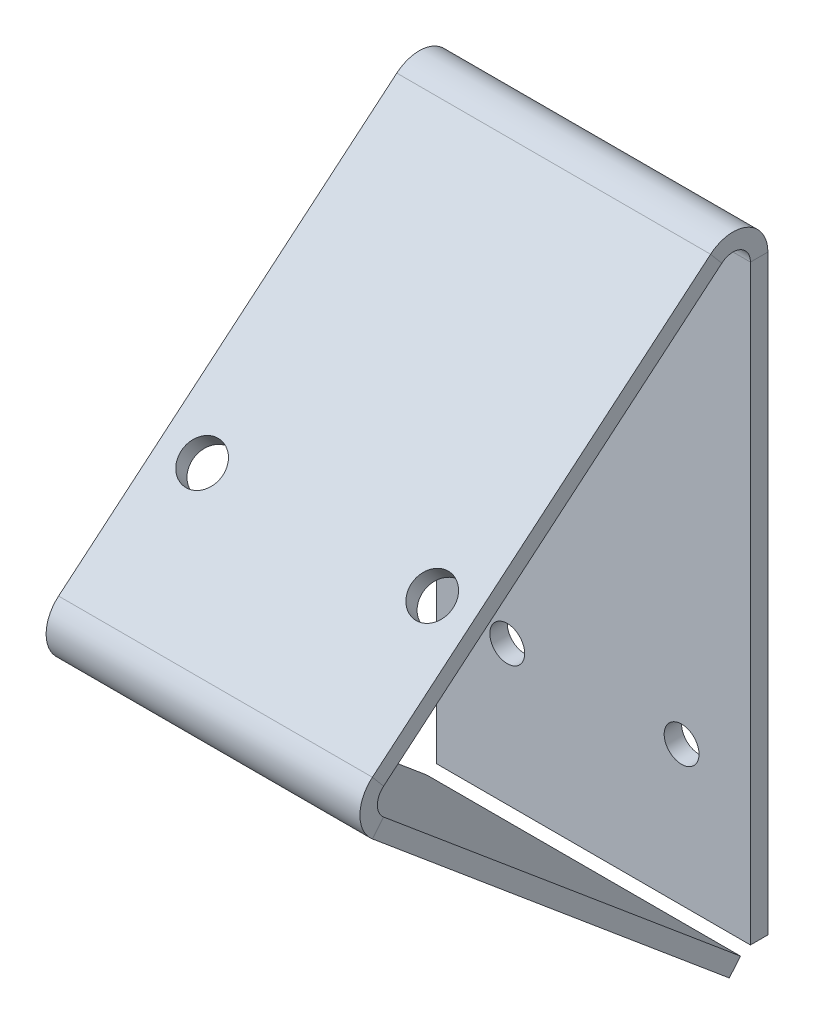
ISO-10303-21;
HEADER;
FILE_DESCRIPTION(('STEP AP214'),'2;1');
FILE_NAME('part.step','',(''),(''),'','','');
FILE_SCHEMA(('AUTOMOTIVE_DESIGN { 1 0 10303 214 1 1 1 1 }'));
ENDSEC;
DATA;
#1=APPLICATION_CONTEXT('core data for automotive mechanical design processes');
#2=APPLICATION_PROTOCOL_DEFINITION('international standard','automotive_design',2000,#1);
#3=PRODUCT_CONTEXT('',#1,'mechanical');
#4=PRODUCT('Part','Part','',(#3));
#5=PRODUCT_RELATED_PRODUCT_CATEGORY('part','',(#4));
#6=PRODUCT_DEFINITION_FORMATION('','',#4);
#7=PRODUCT_DEFINITION_CONTEXT('part definition',#1,'design');
#8=PRODUCT_DEFINITION('design','',#6,#7);
#9=PRODUCT_DEFINITION_SHAPE('','',#8);
#10=(LENGTH_UNIT() NAMED_UNIT(*) SI_UNIT(.MILLI.,.METRE.));
#11=(NAMED_UNIT(*) PLANE_ANGLE_UNIT() SI_UNIT($,.RADIAN.));
#12=(NAMED_UNIT(*) SI_UNIT($,.STERADIAN.) SOLID_ANGLE_UNIT());
#13=UNCERTAINTY_MEASURE_WITH_UNIT(LENGTH_MEASURE(1.E-05),#10,'distance_accuracy_value','');
#14=(GEOMETRIC_REPRESENTATION_CONTEXT(3) GLOBAL_UNCERTAINTY_ASSIGNED_CONTEXT((#13)) GLOBAL_UNIT_ASSIGNED_CONTEXT((#10,
#11,#12)) REPRESENTATION_CONTEXT('',''));
#15=CARTESIAN_POINT('',(0.,0.,0.));
#16=DIRECTION('',(0.,0.,1.));
#17=DIRECTION('',(1.,0.,0.));
#18=AXIS2_PLACEMENT_3D('',#15,#16,#17);
#19=CARTESIAN_POINT('',(-216.953914114597,121.828309810006,102.226089828528));
#20=DIRECTION('',(1.,0.,0.));
#21=DIRECTION('',(0.,-0.642787609686543,0.766044443118975));
#22=AXIS2_PLACEMENT_3D('',#19,#20,#21);
#23=PLANE('',#22);
#24=DIRECTION('',(0.,0.766044443118975,0.642787609686543));
#25=VECTOR('',#24,1.);
#26=CARTESIAN_POINT('',(-216.953914114597,142.748478512065,77.2944036201722));
#27=LINE('',#26,#25);
#28=CARTESIAN_POINT('',(-216.953914114597,140.316287405162,75.2535529594174));
#29=VERTEX_POINT('',#28);
#30=CARTESIAN_POINT('',(-216.953914114597,142.748478512065,77.2944036201722));
#31=VERTEX_POINT('',#30);
#32=EDGE_CURVE('E12',#29,#31,#27,.T.);
#33=ORIENTED_EDGE('',*,*,#32,.F.);
#34=DIRECTION('',(0.,0.642787609686543,-0.766044443118975));
#35=VECTOR('',#34,1.);
#36=CARTESIAN_POINT('',(-216.953914114597,119.396118703103,100.185239167773));
#37=LINE('',#36,#35);
#38=CARTESIAN_POINT('',(-216.953914114597,192.001158760502,13.657921838922));
#39=VERTEX_POINT('',#38);
#40=EDGE_CURVE('E167',#39,#29,#37,.F.);
#41=ORIENTED_EDGE('',*,*,#40,.F.);
#42=DIRECTION('',(0.,0.766044443118974,0.642787609686544));
#43=VECTOR('',#42,1.);
#44=CARTESIAN_POINT('',(-216.953914114597,194.433349867405,15.6987724996768));
#45=LINE('',#44,#43);
#46=CARTESIAN_POINT('',(-216.953914114597,194.433349867405,15.6987724996768));
#47=VERTEX_POINT('',#46);
#48=EDGE_CURVE('E57',#39,#47,#45,.T.);
#49=ORIENTED_EDGE('',*,*,#48,.T.);
#50=DIRECTION('',(0.,-0.642787609686543,0.766044443118975));
#51=VECTOR('',#50,1.);
#52=CARTESIAN_POINT('',(-216.953914114597,121.828309810006,102.226089828528));
#53=LINE('',#52,#51);
#54=EDGE_CURVE('E265',#47,#31,#53,.T.);
#55=ORIENTED_EDGE('',*,*,#54,.T.);
#56=EDGE_LOOP('',(#33,#41,#49,#55));
#57=FACE_BOUND('',#56,.T.);
#58=ADVANCED_FACE('F47',(#57),#23,.T.);
#59=CARTESIAN_POINT('',(-216.953914114597,189.5689676536,11.6170711781672));
#60=DIRECTION('',(-1.,0.,0.));
#61=DIRECTION('',(0.,0.,1.));
#62=AXIS2_PLACEMENT_3D('',#59,#60,#61);
#63=PLANE('',#62);
#64=ORIENTED_EDGE('',*,*,#48,.F.);
#65=CARTESIAN_POINT('',(-216.953914114597,189.5689676536,11.6170711781672));
#66=DIRECTION('',(-1.,0.,0.));
#67=DIRECTION('',(0.,0.,1.));
#68=AXIS2_PLACEMENT_3D('',#65,#66,#67);
#69=CIRCLE('',#68,3.175);
#70=CARTESIAN_POINT('',(-216.953914114597,189.5689676536,8.44207117816722));
#71=VERTEX_POINT('',#70);
#72=EDGE_CURVE('E171',#39,#71,#69,.T.);
#73=ORIENTED_EDGE('',*,*,#72,.T.);
#74=DIRECTION('',(0.,0.,-1.));
#75=VECTOR('',#74,1.);
#76=CARTESIAN_POINT('',(-216.953914114597,189.5689676536,5.26707117816722));
#77=LINE('',#76,#75);
#78=CARTESIAN_POINT('',(-216.953914114597,189.5689676536,5.26707117816722));
#79=VERTEX_POINT('',#78);
#80=EDGE_CURVE('E205',#71,#79,#77,.T.);
#81=ORIENTED_EDGE('',*,*,#80,.T.);
#82=CARTESIAN_POINT('',(-216.953914114597,189.5689676536,11.6170711781672));
#83=DIRECTION('',(1.,0.,0.));
#84=DIRECTION('',(0.,0.,-1.));
#85=AXIS2_PLACEMENT_3D('',#82,#83,#84);
#86=CIRCLE('',#85,6.35);
#87=EDGE_CURVE('E282',#47,#79,#86,.F.);
#88=ORIENTED_EDGE('',*,*,#87,.F.);
#89=EDGE_LOOP('',(#64,#73,#81,#88));
#90=FACE_BOUND('',#89,.T.);
#91=ADVANCED_FACE('F301',(#90),#63,.F.);
#92=CARTESIAN_POINT('',(-216.953914114597,0.,5.26707117816726));
#93=DIRECTION('',(1.,0.,0.));
#94=DIRECTION('',(0.,1.,0.));
#95=AXIS2_PLACEMENT_3D('',#92,#93,#94);
#96=PLANE('',#95);
#97=ORIENTED_EDGE('',*,*,#80,.F.);
#98=DIRECTION('',(0.,-1.,0.));
#99=VECTOR('',#98,1.);
#100=CARTESIAN_POINT('',(-216.953914114597,0.,8.44207117816726));
#101=LINE('',#100,#99);
#102=CARTESIAN_POINT('',(-216.953914114597,81.8630845770558,8.44207117816724));
#103=VERTEX_POINT('',#102);
#104=EDGE_CURVE('E157',#103,#71,#101,.F.);
#105=ORIENTED_EDGE('',*,*,#104,.F.);
#106=DIRECTION('',(0.,0.,-1.));
#107=VECTOR('',#106,1.);
#108=CARTESIAN_POINT('',(-216.953914114597,81.8630845770558,5.26707117816724));
#109=LINE('',#108,#107);
#110=CARTESIAN_POINT('',(-216.953914114597,81.8630845770558,5.26707117816724));
#111=VERTEX_POINT('',#110);
#112=EDGE_CURVE('E202',#103,#111,#109,.T.);
#113=ORIENTED_EDGE('',*,*,#112,.T.);
#114=DIRECTION('',(0.,1.,0.));
#115=VECTOR('',#114,1.);
#116=CARTESIAN_POINT('',(-216.953914114597,0.,5.26707117816726));
#117=LINE('',#116,#115);
#118=EDGE_CURVE('E249',#111,#79,#117,.T.);
#119=ORIENTED_EDGE('',*,*,#118,.T.);
#120=EDGE_LOOP('',(#97,#105,#113,#119));
#121=FACE_BOUND('',#120,.T.);
#122=ADVANCED_FACE('F247',(#121),#96,.T.);
#123=CARTESIAN_POINT('',(-216.953914114597,81.8630845770558,5.26707117816724));
#124=DIRECTION('',(0.,1.,0.));
#125=DIRECTION('',(-1.,0.,0.));
#126=AXIS2_PLACEMENT_3D('',#123,#124,#125);
#127=PLANE('',#126);
#128=ORIENTED_EDGE('',*,*,#112,.F.);
#129=DIRECTION('',(1.,0.,0.));
#130=VECTOR('',#129,1.);
#131=CARTESIAN_POINT('',(-216.953914114597,81.8630845770558,8.44207117816724));
#132=LINE('',#131,#130);
#133=CARTESIAN_POINT('',(-274.103914114597,81.8630845770558,8.44207117816724));
#134=VERTEX_POINT('',#133);
#135=EDGE_CURVE('E152',#103,#134,#132,.F.);
#136=ORIENTED_EDGE('',*,*,#135,.T.);
#137=DIRECTION('',(0.,0.,-1.));
#138=VECTOR('',#137,1.);
#139=CARTESIAN_POINT('',(-274.103914114597,81.8630845770558,5.26707117816724));
#140=LINE('',#139,#138);
#141=CARTESIAN_POINT('',(-274.103914114597,81.8630845770558,5.26707117816724));
#142=VERTEX_POINT('',#141);
#143=EDGE_CURVE('E199',#134,#142,#140,.T.);
#144=ORIENTED_EDGE('',*,*,#143,.T.);
#145=DIRECTION('',(-1.,0.,0.));
#146=VECTOR('',#145,1.);
#147=CARTESIAN_POINT('',(-216.953914114597,81.8630845770558,5.26707117816724));
#148=LINE('',#147,#146);
#149=EDGE_CURVE('E243',#111,#142,#148,.T.);
#150=ORIENTED_EDGE('',*,*,#149,.F.);
#151=EDGE_LOOP('',(#128,#136,#144,#150));
#152=FACE_BOUND('',#151,.T.);
#153=ADVANCED_FACE('F239',(#152),#127,.F.);
#154=CARTESIAN_POINT('',(-274.103914114597,0.,5.26707117816726));
#155=DIRECTION('',(1.,0.,0.));
#156=DIRECTION('',(0.,1.,0.));
#157=AXIS2_PLACEMENT_3D('',#154,#155,#156);
#158=PLANE('',#157);
#159=ORIENTED_EDGE('',*,*,#143,.F.);
#160=DIRECTION('',(0.,-1.,0.));
#161=VECTOR('',#160,1.);
#162=CARTESIAN_POINT('',(-274.103914114597,0.,8.44207117816726));
#163=LINE('',#162,#161);
#164=CARTESIAN_POINT('',(-274.103914114597,189.5689676536,8.44207117816721));
#165=VERTEX_POINT('',#164);
#166=EDGE_CURVE('E172',#134,#165,#163,.F.);
#167=ORIENTED_EDGE('',*,*,#166,.T.);
#168=DIRECTION('',(0.,0.,-1.));
#169=VECTOR('',#168,1.);
#170=CARTESIAN_POINT('',(-274.103914114597,189.5689676536,5.26707117816722));
#171=LINE('',#170,#169);
#172=CARTESIAN_POINT('',(-274.103914114597,189.5689676536,5.26707117816722));
#173=VERTEX_POINT('',#172);
#174=EDGE_CURVE('E196',#165,#173,#171,.T.);
#175=ORIENTED_EDGE('',*,*,#174,.T.);
#176=DIRECTION('',(0.,1.,0.));
#177=VECTOR('',#176,1.);
#178=CARTESIAN_POINT('',(-274.103914114597,0.,5.26707117816726));
#179=LINE('',#178,#177);
#180=EDGE_CURVE('E260',#142,#173,#179,.T.);
#181=ORIENTED_EDGE('',*,*,#180,.F.);
#182=EDGE_LOOP('',(#159,#167,#175,#181));
#183=FACE_BOUND('',#182,.T.);
#184=ADVANCED_FACE('F312',(#183),#158,.F.);
#185=CARTESIAN_POINT('',(-274.103914114597,189.5689676536,11.6170711781672));
#186=DIRECTION('',(1.,0.,0.));
#187=DIRECTION('',(0.,0.,-1.));
#188=AXIS2_PLACEMENT_3D('',#185,#186,#187);
#189=PLANE('',#188);
#190=ORIENTED_EDGE('',*,*,#174,.F.);
#191=CARTESIAN_POINT('',(-274.103914114597,189.5689676536,11.6170711781672));
#192=DIRECTION('',(-1.,0.,0.));
#193=DIRECTION('',(0.,0.,1.));
#194=AXIS2_PLACEMENT_3D('',#191,#192,#193);
#195=CIRCLE('',#194,3.175);
#196=CARTESIAN_POINT('',(-274.103914114597,192.001158760502,13.657921838922));
#197=VERTEX_POINT('',#196);
#198=EDGE_CURVE('E147',#165,#197,#195,.F.);
#199=ORIENTED_EDGE('',*,*,#198,.T.);
#200=DIRECTION('',(0.,0.766044443118975,0.642787609686543));
#201=VECTOR('',#200,1.);
#202=CARTESIAN_POINT('',(-274.103914114597,194.433349867405,15.6987724996768));
#203=LINE('',#202,#201);
#204=CARTESIAN_POINT('',(-274.103914114597,194.433349867405,15.6987724996768));
#205=VERTEX_POINT('',#204);
#206=EDGE_CURVE('E193',#197,#205,#203,.T.);
#207=ORIENTED_EDGE('',*,*,#206,.T.);
#208=CARTESIAN_POINT('',(-274.103914114597,189.5689676536,11.6170711781672));
#209=DIRECTION('',(-1.,0.,0.));
#210=DIRECTION('',(0.,0.,1.));
#211=AXIS2_PLACEMENT_3D('',#208,#209,#210);
#212=CIRCLE('',#211,6.35);
#213=EDGE_CURVE('E279',#173,#205,#212,.F.);
#214=ORIENTED_EDGE('',*,*,#213,.F.);
#215=EDGE_LOOP('',(#190,#199,#207,#214));
#216=FACE_BOUND('',#215,.T.);
#217=ADVANCED_FACE('F308',(#216),#189,.F.);
#218=CARTESIAN_POINT('',(-274.103914114597,121.828309810006,102.226089828528));
#219=DIRECTION('',(1.,0.,0.));
#220=DIRECTION('',(0.,-0.642787609686543,0.766044443118975));
#221=AXIS2_PLACEMENT_3D('',#218,#219,#220);
#222=PLANE('',#221);
#223=ORIENTED_EDGE('',*,*,#206,.F.);
#224=DIRECTION('',(0.,0.642787609686543,-0.766044443118975));
#225=VECTOR('',#224,1.);
#226=CARTESIAN_POINT('',(-274.103914114597,119.396118703103,100.185239167773));
#227=LINE('',#226,#225);
#228=CARTESIAN_POINT('',(-274.103914114597,140.316287405162,75.2535529594174));
#229=VERTEX_POINT('',#228);
#230=EDGE_CURVE('E165',#197,#229,#227,.F.);
#231=ORIENTED_EDGE('',*,*,#230,.T.);
#232=DIRECTION('',(0.,0.766044443118975,0.642787609686543));
#233=VECTOR('',#232,1.);
#234=CARTESIAN_POINT('',(-274.103914114597,142.748478512065,77.2944036201722));
#235=LINE('',#234,#233);
#236=CARTESIAN_POINT('',(-274.103914114597,142.748478512065,77.2944036201722));
#237=VERTEX_POINT('',#236);
#238=EDGE_CURVE('E66',#229,#237,#235,.T.);
#239=ORIENTED_EDGE('',*,*,#238,.T.);
#240=DIRECTION('',(0.,-0.642787609686543,0.766044443118975));
#241=VECTOR('',#240,1.);
#242=CARTESIAN_POINT('',(-274.103914114597,121.828309810006,102.226089828528));
#243=LINE('',#242,#241);
#244=EDGE_CURVE('E649',#205,#237,#243,.T.);
#245=ORIENTED_EDGE('',*,*,#244,.F.);
#246=EDGE_LOOP('',(#223,#231,#239,#245));
#247=FACE_BOUND('',#246,.T.);
#248=ADVANCED_FACE('F529',(#247),#222,.F.);
#249=CARTESIAN_POINT('',(-274.103914114597,137.88409629826,73.2127022986627));
#250=DIRECTION('',(1.,0.,0.));
#251=DIRECTION('',(0.,0.,-1.));
#252=AXIS2_PLACEMENT_3D('',#249,#250,#251);
#253=PLANE('',#252);
#254=ORIENTED_EDGE('',*,*,#238,.F.);
#255=CARTESIAN_POINT('',(-274.103914114597,137.88409629826,73.2127022986627));
#256=DIRECTION('',(-1.,0.,0.));
#257=DIRECTION('',(0.,0.,1.));
#258=AXIS2_PLACEMENT_3D('',#255,#256,#257);
#259=CIRCLE('',#258,3.175);
#260=CARTESIAN_POINT('',(-274.103914114597,135.449952750407,75.2512238679499));
#261=VERTEX_POINT('',#260);
#262=EDGE_CURVE('E148',#229,#261,#259,.F.);
#263=ORIENTED_EDGE('',*,*,#262,.T.);
#264=DIRECTION('',(0.,-0.766659385150302,0.642054037570795));
#265=VECTOR('',#264,1.);
#266=CARTESIAN_POINT('',(-274.103914114597,133.015809202555,77.2897454372372));
#267=LINE('',#266,#265);
#268=CARTESIAN_POINT('',(-274.103914114597,133.015809202555,77.2897454372372));
#269=VERTEX_POINT('',#268);
#270=EDGE_CURVE('E189',#261,#269,#267,.T.);
#271=ORIENTED_EDGE('',*,*,#270,.T.);
#272=CARTESIAN_POINT('',(-274.103914114597,137.88409629826,73.2127022986627));
#273=DIRECTION('',(-1.,0.,0.));
#274=DIRECTION('',(0.,0.,1.));
#275=AXIS2_PLACEMENT_3D('',#272,#273,#274);
#276=CIRCLE('',#275,6.35);
#277=EDGE_CURVE('E290',#237,#269,#276,.F.);
#278=ORIENTED_EDGE('',*,*,#277,.F.);
#279=EDGE_LOOP('',(#254,#263,#271,#278));
#280=FACE_BOUND('',#279,.T.);
#281=ADVANCED_FACE('F339',(#280),#253,.F.);
#282=CARTESIAN_POINT('',(-274.103914114597,40.1373982424596,-33.6138565552235));
#283=DIRECTION('',(1.,0.,0.));
#284=DIRECTION('',(0.,-0.642054037570795,-0.766659385150302));
#285=AXIS2_PLACEMENT_3D('',#282,#283,#284);
#286=PLANE('',#285);
#287=ORIENTED_EDGE('',*,*,#270,.F.);
#288=DIRECTION('',(0.,0.642054037570795,0.766659385150303));
#289=VECTOR('',#288,1.);
#290=CARTESIAN_POINT('',(-274.103914114597,42.5715417903118,-35.6523781245108));
#291=LINE('',#290,#289);
#292=CARTESIAN_POINT('',(-274.103914114597,81.0169806089417,10.254282003414));
#293=VERTEX_POINT('',#292);
#294=EDGE_CURVE('E137',#261,#293,#291,.F.);
#295=ORIENTED_EDGE('',*,*,#294,.T.);
#296=DIRECTION('',(0.,-0.766659385150302,0.642054037570795));
#297=VECTOR('',#296,1.);
#298=CARTESIAN_POINT('',(-274.103914114597,78.5828370610895,12.2928035727013));
#299=LINE('',#298,#297);
#300=CARTESIAN_POINT('',(-274.103914114597,78.5828370610895,12.2928035727013));
#301=VERTEX_POINT('',#300);
#302=EDGE_CURVE('E186',#293,#301,#299,.T.);
#303=ORIENTED_EDGE('',*,*,#302,.T.);
#304=DIRECTION('',(0.,-0.642054037570795,-0.766659385150302));
#305=VECTOR('',#304,1.);
#306=CARTESIAN_POINT('',(-274.103914114597,40.1373982424596,-33.6138565552235));
#307=LINE('',#306,#305);
#308=EDGE_CURVE('E259',#269,#301,#307,.T.);
#309=ORIENTED_EDGE('',*,*,#308,.F.);
#310=EDGE_LOOP('',(#287,#295,#303,#309));
#311=FACE_BOUND('',#310,.T.);
#312=ADVANCED_FACE('F325',(#311),#286,.F.);
#313=CARTESIAN_POINT('',(-216.953914114597,78.5828370610895,12.2928035727013));
#314=DIRECTION('',(0.,0.642054037570795,0.766659385150303));
#315=DIRECTION('',(1.,0.,0.));
#316=AXIS2_PLACEMENT_3D('',#313,#314,#315);
#317=PLANE('',#316);
#318=ORIENTED_EDGE('',*,*,#302,.F.);
#319=DIRECTION('',(1.,0.,0.));
#320=VECTOR('',#319,1.);
#321=CARTESIAN_POINT('',(-216.953914114597,81.0169806089417,10.254282003414));
#322=LINE('',#321,#320);
#323=CARTESIAN_POINT('',(-216.953914114597,81.0169806089417,10.254282003414));
#324=VERTEX_POINT('',#323);
#325=EDGE_CURVE('E155',#293,#324,#322,.T.);
#326=ORIENTED_EDGE('',*,*,#325,.T.);
#327=DIRECTION('',(0.,-0.766659385150302,0.642054037570795));
#328=VECTOR('',#327,1.);
#329=CARTESIAN_POINT('',(-216.953914114597,78.5828370610895,12.2928035727013));
#330=LINE('',#329,#328);
#331=CARTESIAN_POINT('',(-216.953914114597,78.5828370610895,12.2928035727013));
#332=VERTEX_POINT('',#331);
#333=EDGE_CURVE('E124',#324,#332,#330,.T.);
#334=ORIENTED_EDGE('',*,*,#333,.T.);
#335=DIRECTION('',(1.,0.,0.));
#336=VECTOR('',#335,1.);
#337=CARTESIAN_POINT('',(-216.953914114597,78.5828370610895,12.2928035727013));
#338=LINE('',#337,#336);
#339=EDGE_CURVE('E271',#301,#332,#338,.T.);
#340=ORIENTED_EDGE('',*,*,#339,.F.);
#341=EDGE_LOOP('',(#318,#326,#334,#340));
#342=FACE_BOUND('',#341,.T.);
#343=ADVANCED_FACE('F330',(#342),#317,.F.);
#344=CARTESIAN_POINT('',(-216.953914114597,40.1373982424596,-33.6138565552235));
#345=DIRECTION('',(1.,0.,0.));
#346=DIRECTION('',(0.,-0.642054037570795,-0.766659385150302));
#347=AXIS2_PLACEMENT_3D('',#344,#345,#346);
#348=PLANE('',#347);
#349=ORIENTED_EDGE('',*,*,#333,.F.);
#350=DIRECTION('',(0.,0.642054037570795,0.766659385150303));
#351=VECTOR('',#350,1.);
#352=CARTESIAN_POINT('',(-216.953914114597,42.5715417903118,-35.6523781245108));
#353=LINE('',#352,#351);
#354=CARTESIAN_POINT('',(-216.953914114597,135.449952750407,75.25122386795));
#355=VERTEX_POINT('',#354);
#356=EDGE_CURVE('E134',#355,#324,#353,.F.);
#357=ORIENTED_EDGE('',*,*,#356,.F.);
#358=DIRECTION('',(0.,-0.766659385150302,0.642054037570796));
#359=VECTOR('',#358,1.);
#360=CARTESIAN_POINT('',(-216.953914114597,133.015809202555,77.2897454372372));
#361=LINE('',#360,#359);
#362=CARTESIAN_POINT('',(-216.953914114597,133.015809202555,77.2897454372372));
#363=VERTEX_POINT('',#362);
#364=EDGE_CURVE('E112',#355,#363,#361,.T.);
#365=ORIENTED_EDGE('',*,*,#364,.T.);
#366=DIRECTION('',(0.,-0.642054037570795,-0.766659385150302));
#367=VECTOR('',#366,1.);
#368=CARTESIAN_POINT('',(-216.953914114597,40.1373982424596,-33.6138565552235));
#369=LINE('',#368,#367);
#370=EDGE_CURVE('E263',#363,#332,#369,.T.);
#371=ORIENTED_EDGE('',*,*,#370,.T.);
#372=EDGE_LOOP('',(#349,#357,#365,#371));
#373=FACE_BOUND('',#372,.T.);
#374=ADVANCED_FACE('F150',(#373),#348,.T.);
#375=CARTESIAN_POINT('',(-266.483914114597,158.28787206223,58.7752755300277));
#376=DIRECTION('',(0.,-0.766044443118975,-0.642787609686543));
#377=DIRECTION('',(0.,0.642787609686543,-0.766044443118975));
#378=AXIS2_PLACEMENT_3D('',#375,#376,#377);
#379=CYLINDRICAL_SURFACE('',#378,3.80999999999998);
#380=CARTESIAN_POINT('',(-266.483914114597,158.28787206223,58.7752755300277));
#381=DIRECTION('',(0.,0.766044443118975,0.642787609686543));
#382=DIRECTION('',(0.,-0.642787609686543,0.766044443118975));
#383=AXIS2_PLACEMENT_3D('',#380,#381,#382);
#384=CIRCLE('',#383,3.80999999999998);
#385=CARTESIAN_POINT('',(-266.483914114597,155.838851269325,61.6939048583109));
#386=VERTEX_POINT('',#385);
#387=EDGE_CURVE('E285',#386,#386,#384,.T.);
#388=ORIENTED_EDGE('',*,*,#387,.T.);
#389=EDGE_LOOP('',(#388));
#390=FACE_BOUND('',#389,.T.);
#391=CARTESIAN_POINT('',(-266.483914114597,155.855680955328,56.7344248692729));
#392=DIRECTION('',(0.,0.766044443118975,0.642787609686543));
#393=DIRECTION('',(0.,-0.642787609686543,0.766044443118975));
#394=AXIS2_PLACEMENT_3D('',#391,#392,#393);
#395=CIRCLE('',#394,3.80999999999998);
#396=CARTESIAN_POINT('',(-266.483914114597,153.406660162422,59.6530541975562));
#397=VERTEX_POINT('',#396);
#398=EDGE_CURVE('E179',#397,#397,#395,.T.);
#399=ORIENTED_EDGE('',*,*,#398,.F.);
#400=EDGE_LOOP('',(#399));
#401=FACE_BOUND('',#400,.T.);
#402=ADVANCED_FACE('F337',(#390,#401),#379,.F.);
#403=CARTESIAN_POINT('',(-224.573914114597,158.28787206223,58.7752755300276));
#404=DIRECTION('',(0.,-0.766044443118975,-0.642787609686543));
#405=DIRECTION('',(0.,0.642787609686543,-0.766044443118975));
#406=AXIS2_PLACEMENT_3D('',#403,#404,#405);
#407=CYLINDRICAL_SURFACE('',#406,3.81000000000002);
#408=CARTESIAN_POINT('',(-224.573914114597,158.28787206223,58.7752755300276));
#409=DIRECTION('',(0.,0.766044443118975,0.642787609686543));
#410=DIRECTION('',(0.,-0.642787609686543,0.766044443118975));
#411=AXIS2_PLACEMENT_3D('',#408,#409,#410);
#412=CIRCLE('',#411,3.81000000000002);
#413=CARTESIAN_POINT('',(-224.573914114597,155.838851269325,61.693904858311));
#414=VERTEX_POINT('',#413);
#415=EDGE_CURVE('E650',#414,#414,#412,.T.);
#416=ORIENTED_EDGE('',*,*,#415,.T.);
#417=EDGE_LOOP('',(#416));
#418=FACE_BOUND('',#417,.T.);
#419=CARTESIAN_POINT('',(-224.573914114597,155.855680955328,56.7344248692729));
#420=DIRECTION('',(0.,0.766044443118975,0.642787609686543));
#421=DIRECTION('',(0.,-0.642787609686543,0.766044443118975));
#422=AXIS2_PLACEMENT_3D('',#419,#420,#421);
#423=CIRCLE('',#422,3.81000000000002);
#424=CARTESIAN_POINT('',(-224.573914114597,153.406660162422,59.6530541975562));
#425=VERTEX_POINT('',#424);
#426=EDGE_CURVE('E168',#425,#425,#423,.T.);
#427=ORIENTED_EDGE('',*,*,#426,.F.);
#428=EDGE_LOOP('',(#427));
#429=FACE_BOUND('',#428,.T.);
#430=ADVANCED_FACE('F49',(#418,#429),#407,.F.);
#431=CARTESIAN_POINT('',(-216.953914114597,137.88409629826,73.2127022986627));
#432=DIRECTION('',(-1.,0.,0.));
#433=DIRECTION('',(0.,0.,1.));
#434=AXIS2_PLACEMENT_3D('',#431,#432,#433);
#435=PLANE('',#434);
#436=CARTESIAN_POINT('',(-216.953914114597,137.88409629826,73.2127022986627));
#437=DIRECTION('',(-1.,0.,0.));
#438=DIRECTION('',(0.,0.,1.));
#439=AXIS2_PLACEMENT_3D('',#436,#437,#438);
#440=CIRCLE('',#439,3.175);
#441=EDGE_CURVE('E116',#355,#29,#440,.T.);
#442=ORIENTED_EDGE('',*,*,#441,.T.);
#443=ORIENTED_EDGE('',*,*,#32,.T.);
#444=CARTESIAN_POINT('',(-216.953914114597,137.88409629826,73.2127022986627));
#445=DIRECTION('',(1.,0.,0.));
#446=DIRECTION('',(0.,0.,-1.));
#447=AXIS2_PLACEMENT_3D('',#444,#445,#446);
#448=CIRCLE('',#447,6.35);
#449=EDGE_CURVE('E118',#363,#31,#448,.F.);
#450=ORIENTED_EDGE('',*,*,#449,.F.);
#451=ORIENTED_EDGE('',*,*,#364,.F.);
#452=EDGE_LOOP('',(#442,#443,#450,#451));
#453=FACE_BOUND('',#452,.T.);
#454=ADVANCED_FACE('F114',(#453),#435,.F.);
#455=CARTESIAN_POINT('',(-216.953914114597,40.1373982424596,-33.6138565552235));
#456=DIRECTION('',(0.,0.766659385150302,-0.642054037570795));
#457=DIRECTION('',(0.,0.642054037570795,0.766659385150303));
#458=AXIS2_PLACEMENT_3D('',#455,#456,#457);
#459=PLANE('',#458);
#460=ORIENTED_EDGE('',*,*,#370,.F.);
#461=DIRECTION('',(-1.,0.,0.));
#462=VECTOR('',#461,1.);
#463=CARTESIAN_POINT('',(-216.953914114597,133.015809202555,77.2897454372372));
#464=LINE('',#463,#462);
#465=EDGE_CURVE('E278',#363,#269,#464,.T.);
#466=ORIENTED_EDGE('',*,*,#465,.T.);
#467=ORIENTED_EDGE('',*,*,#308,.T.);
#468=ORIENTED_EDGE('',*,*,#339,.T.);
#469=EDGE_LOOP('',(#460,#466,#467,#468));
#470=FACE_BOUND('',#469,.T.);
#471=ADVANCED_FACE('F329',(#470),#459,.F.);
#472=CARTESIAN_POINT('',(-216.953914114597,0.,5.26707117816726));
#473=DIRECTION('',(0.,0.,1.));
#474=DIRECTION('',(0.,-1.,0.));
#475=AXIS2_PLACEMENT_3D('',#472,#473,#474);
#476=PLANE('',#475);
#477=CARTESIAN_POINT('',(-229.494923600473,107.263084577056,5.26707117816726));
#478=DIRECTION('',(0.,0.,-1.));
#479=DIRECTION('',(-1.,0.,0.));
#480=AXIS2_PLACEMENT_3D('',#477,#478,#479);
#481=CIRCLE('',#480,3.175);
#482=CARTESIAN_POINT('',(-232.669923600473,107.263084577056,5.26707117816726));
#483=VERTEX_POINT('',#482);
#484=EDGE_CURVE('E213',#483,#483,#481,.T.);
#485=ORIENTED_EDGE('',*,*,#484,.F.);
#486=EDGE_LOOP('',(#485));
#487=FACE_BOUND('',#486,.T.);
#488=CARTESIAN_POINT('',(-261.244923600473,107.263084577056,5.26707117816726));
#489=DIRECTION('',(0.,0.,-1.));
#490=DIRECTION('',(-1.,0.,0.));
#491=AXIS2_PLACEMENT_3D('',#488,#489,#490);
#492=CIRCLE('',#491,3.17500000000003);
#493=CARTESIAN_POINT('',(-264.419923600473,107.263084577056,5.26707117816726));
#494=VERTEX_POINT('',#493);
#495=EDGE_CURVE('E659',#494,#494,#492,.T.);
#496=ORIENTED_EDGE('',*,*,#495,.F.);
#497=EDGE_LOOP('',(#496));
#498=FACE_BOUND('',#497,.T.);
#499=CARTESIAN_POINT('',(-245.369923600473,151.713084577056,5.26707117816726));
#500=DIRECTION('',(0.,0.,-1.));
#501=DIRECTION('',(-1.,0.,0.));
#502=AXIS2_PLACEMENT_3D('',#499,#500,#501);
#503=CIRCLE('',#502,3.17499999999997);
#504=CARTESIAN_POINT('',(-248.544923600473,151.713084577056,5.26707117816726));
#505=VERTEX_POINT('',#504);
#506=EDGE_CURVE('E656',#505,#505,#503,.T.);
#507=ORIENTED_EDGE('',*,*,#506,.F.);
#508=EDGE_LOOP('',(#507));
#509=FACE_BOUND('',#508,.T.);
#510=ORIENTED_EDGE('',*,*,#180,.T.);
#511=DIRECTION('',(-1.,0.,0.));
#512=VECTOR('',#511,1.);
#513=CARTESIAN_POINT('',(-216.953914114597,189.5689676536,5.26707117816722));
#514=LINE('',#513,#512);
#515=EDGE_CURVE('E258',#173,#79,#514,.F.);
#516=ORIENTED_EDGE('',*,*,#515,.T.);
#517=ORIENTED_EDGE('',*,*,#118,.F.);
#518=ORIENTED_EDGE('',*,*,#149,.T.);
#519=EDGE_LOOP('',(#510,#516,#517,#518));
#520=FACE_BOUND('',#519,.T.);
#521=ADVANCED_FACE('F255',(#487,#498,#509,#520),#476,.F.);
#522=CARTESIAN_POINT('',(-216.953914114597,121.828309810006,102.226089828528));
#523=DIRECTION('',(0.,-0.766044443118975,-0.642787609686543));
#524=DIRECTION('',(0.,0.642787609686543,-0.766044443118975));
#525=AXIS2_PLACEMENT_3D('',#522,#523,#524);
#526=PLANE('',#525);
#527=ORIENTED_EDGE('',*,*,#387,.F.);
#528=EDGE_LOOP('',(#527));
#529=FACE_BOUND('',#528,.T.);
#530=ORIENTED_EDGE('',*,*,#415,.F.);
#531=EDGE_LOOP('',(#530));
#532=FACE_BOUND('',#531,.T.);
#533=ORIENTED_EDGE('',*,*,#244,.T.);
#534=DIRECTION('',(-1.,0.,0.));
#535=VECTOR('',#534,1.);
#536=CARTESIAN_POINT('',(-216.953914114597,142.748478512065,77.2944036201722));
#537=LINE('',#536,#535);
#538=EDGE_CURVE('E125',#237,#31,#537,.F.);
#539=ORIENTED_EDGE('',*,*,#538,.T.);
#540=ORIENTED_EDGE('',*,*,#54,.F.);
#541=DIRECTION('',(-1.,0.,0.));
#542=VECTOR('',#541,1.);
#543=CARTESIAN_POINT('',(-216.953914114597,194.433349867405,15.6987724996768));
#544=LINE('',#543,#542);
#545=EDGE_CURVE('E274',#47,#205,#544,.T.);
#546=ORIENTED_EDGE('',*,*,#545,.T.);
#547=EDGE_LOOP('',(#533,#539,#540,#546));
#548=FACE_BOUND('',#547,.T.);
#549=ADVANCED_FACE('F387',(#529,#532,#548),#526,.F.);
#550=CARTESIAN_POINT('',(-216.953914114597,189.5689676536,11.6170711781672));
#551=DIRECTION('',(-1.,0.,0.));
#552=DIRECTION('',(0.,0.,1.));
#553=AXIS2_PLACEMENT_3D('',#550,#551,#552);
#554=CYLINDRICAL_SURFACE('',#553,6.35);
#555=ORIENTED_EDGE('',*,*,#87,.T.);
#556=ORIENTED_EDGE('',*,*,#515,.F.);
#557=ORIENTED_EDGE('',*,*,#213,.T.);
#558=ORIENTED_EDGE('',*,*,#545,.F.);
#559=EDGE_LOOP('',(#555,#556,#557,#558));
#560=FACE_BOUND('',#559,.T.);
#561=ADVANCED_FACE('F390',(#560),#554,.T.);
#562=CARTESIAN_POINT('',(-216.953914114597,137.88409629826,73.2127022986627));
#563=DIRECTION('',(-1.,0.,0.));
#564=DIRECTION('',(0.,0.,1.));
#565=AXIS2_PLACEMENT_3D('',#562,#563,#564);
#566=CYLINDRICAL_SURFACE('',#565,6.35);
#567=ORIENTED_EDGE('',*,*,#449,.T.);
#568=ORIENTED_EDGE('',*,*,#538,.F.);
#569=ORIENTED_EDGE('',*,*,#277,.T.);
#570=ORIENTED_EDGE('',*,*,#465,.F.);
#571=EDGE_LOOP('',(#567,#568,#569,#570));
#572=FACE_BOUND('',#571,.T.);
#573=ADVANCED_FACE('F399',(#572),#566,.T.);
#574=CARTESIAN_POINT('',(-216.953914114597,42.5715417903118,-35.6523781245108));
#575=DIRECTION('',(0.,0.766659385150302,-0.642054037570795));
#576=DIRECTION('',(0.,0.642054037570795,0.766659385150303));
#577=AXIS2_PLACEMENT_3D('',#574,#575,#576);
#578=PLANE('',#577);
#579=ORIENTED_EDGE('',*,*,#356,.T.);
#580=ORIENTED_EDGE('',*,*,#325,.F.);
#581=ORIENTED_EDGE('',*,*,#294,.F.);
#582=DIRECTION('',(1.,0.,0.));
#583=VECTOR('',#582,1.);
#584=CARTESIAN_POINT('',(-216.953914114597,135.449952750407,75.25122386795));
#585=LINE('',#584,#583);
#586=EDGE_CURVE('E131',#355,#261,#585,.F.);
#587=ORIENTED_EDGE('',*,*,#586,.F.);
#588=EDGE_LOOP('',(#579,#580,#581,#587));
#589=FACE_BOUND('',#588,.T.);
#590=ADVANCED_FACE('F132',(#589),#578,.T.);
#591=CARTESIAN_POINT('',(-216.953914114597,0.,8.44207117816726));
#592=DIRECTION('',(0.,0.,1.));
#593=DIRECTION('',(0.,-1.,0.));
#594=AXIS2_PLACEMENT_3D('',#591,#592,#593);
#595=PLANE('',#594);
#596=CARTESIAN_POINT('',(-229.494923600473,107.263084577056,8.44207117816724));
#597=DIRECTION('',(0.,0.,1.));
#598=DIRECTION('',(0.,-1.,0.));
#599=AXIS2_PLACEMENT_3D('',#596,#597,#598);
#600=CIRCLE('',#599,3.175);
#601=CARTESIAN_POINT('',(-229.494923600473,104.088084577056,8.44207117816724));
#602=VERTEX_POINT('',#601);
#603=EDGE_CURVE('E51',#602,#602,#600,.T.);
#604=ORIENTED_EDGE('',*,*,#603,.F.);
#605=EDGE_LOOP('',(#604));
#606=FACE_BOUND('',#605,.T.);
#607=CARTESIAN_POINT('',(-261.244923600473,107.263084577056,8.44207117816724));
#608=DIRECTION('',(0.,0.,1.));
#609=DIRECTION('',(0.,-1.,0.));
#610=AXIS2_PLACEMENT_3D('',#607,#608,#609);
#611=CIRCLE('',#610,3.17500000000003);
#612=CARTESIAN_POINT('',(-261.244923600473,104.088084577056,8.44207117816724));
#613=VERTEX_POINT('',#612);
#614=EDGE_CURVE('E212',#613,#613,#611,.T.);
#615=ORIENTED_EDGE('',*,*,#614,.F.);
#616=EDGE_LOOP('',(#615));
#617=FACE_BOUND('',#616,.T.);
#618=CARTESIAN_POINT('',(-245.369923600473,151.713084577056,8.44207117816722));
#619=DIRECTION('',(0.,0.,1.));
#620=DIRECTION('',(0.,-1.,0.));
#621=AXIS2_PLACEMENT_3D('',#618,#619,#620);
#622=CIRCLE('',#621,3.17499999999997);
#623=CARTESIAN_POINT('',(-245.369923600473,148.538084577056,8.44207117816722));
#624=VERTEX_POINT('',#623);
#625=EDGE_CURVE('E210',#624,#624,#622,.T.);
#626=ORIENTED_EDGE('',*,*,#625,.F.);
#627=EDGE_LOOP('',(#626));
#628=FACE_BOUND('',#627,.T.);
#629=ORIENTED_EDGE('',*,*,#166,.F.);
#630=ORIENTED_EDGE('',*,*,#135,.F.);
#631=ORIENTED_EDGE('',*,*,#104,.T.);
#632=DIRECTION('',(1.,0.,0.));
#633=VECTOR('',#632,1.);
#634=CARTESIAN_POINT('',(-216.953914114597,189.5689676536,8.44207117816721));
#635=LINE('',#634,#633);
#636=EDGE_CURVE('E142',#165,#71,#635,.T.);
#637=ORIENTED_EDGE('',*,*,#636,.F.);
#638=EDGE_LOOP('',(#629,#630,#631,#637));
#639=FACE_BOUND('',#638,.T.);
#640=ADVANCED_FACE('F223',(#606,#617,#628,#639),#595,.T.);
#641=CARTESIAN_POINT('',(-216.953914114597,119.396118703103,100.185239167773));
#642=DIRECTION('',(0.,-0.766044443118975,-0.642787609686543));
#643=DIRECTION('',(0.,0.642787609686543,-0.766044443118975));
#644=AXIS2_PLACEMENT_3D('',#641,#642,#643);
#645=PLANE('',#644);
#646=ORIENTED_EDGE('',*,*,#398,.T.);
#647=EDGE_LOOP('',(#646));
#648=FACE_BOUND('',#647,.T.);
#649=ORIENTED_EDGE('',*,*,#426,.T.);
#650=EDGE_LOOP('',(#649));
#651=FACE_BOUND('',#650,.T.);
#652=ORIENTED_EDGE('',*,*,#230,.F.);
#653=DIRECTION('',(1.,0.,0.));
#654=VECTOR('',#653,1.);
#655=CARTESIAN_POINT('',(-216.953914114597,192.001158760502,13.657921838922));
#656=LINE('',#655,#654);
#657=EDGE_CURVE('E162',#39,#197,#656,.F.);
#658=ORIENTED_EDGE('',*,*,#657,.F.);
#659=ORIENTED_EDGE('',*,*,#40,.T.);
#660=DIRECTION('',(1.,0.,0.));
#661=VECTOR('',#660,1.);
#662=CARTESIAN_POINT('',(-216.953914114597,140.316287405162,75.2535529594174));
#663=LINE('',#662,#661);
#664=EDGE_CURVE('E141',#229,#29,#663,.T.);
#665=ORIENTED_EDGE('',*,*,#664,.F.);
#666=EDGE_LOOP('',(#652,#658,#659,#665));
#667=FACE_BOUND('',#666,.T.);
#668=ADVANCED_FACE('F226',(#648,#651,#667),#645,.T.);
#669=CARTESIAN_POINT('',(-216.953914114597,189.5689676536,11.6170711781672));
#670=DIRECTION('',(-1.,0.,0.));
#671=DIRECTION('',(0.,0.,1.));
#672=AXIS2_PLACEMENT_3D('',#669,#670,#671);
#673=CYLINDRICAL_SURFACE('',#672,3.175);
#674=ORIENTED_EDGE('',*,*,#72,.F.);
#675=ORIENTED_EDGE('',*,*,#657,.T.);
#676=ORIENTED_EDGE('',*,*,#198,.F.);
#677=ORIENTED_EDGE('',*,*,#636,.T.);
#678=EDGE_LOOP('',(#674,#675,#676,#677));
#679=FACE_BOUND('',#678,.T.);
#680=ADVANCED_FACE('F299',(#679),#673,.F.);
#681=CARTESIAN_POINT('',(-216.953914114597,137.88409629826,73.2127022986627));
#682=DIRECTION('',(-1.,0.,0.));
#683=DIRECTION('',(0.,0.,1.));
#684=AXIS2_PLACEMENT_3D('',#681,#682,#683);
#685=CYLINDRICAL_SURFACE('',#684,3.175);
#686=ORIENTED_EDGE('',*,*,#441,.F.);
#687=ORIENTED_EDGE('',*,*,#586,.T.);
#688=ORIENTED_EDGE('',*,*,#262,.F.);
#689=ORIENTED_EDGE('',*,*,#664,.T.);
#690=EDGE_LOOP('',(#686,#687,#688,#689));
#691=FACE_BOUND('',#690,.T.);
#692=ADVANCED_FACE('F144',(#691),#685,.F.);
#693=CARTESIAN_POINT('',(-245.369923600473,151.713084577056,11.1090711781673));
#694=DIRECTION('',(0.,0.,-1.));
#695=DIRECTION('',(-1.,0.,0.));
#696=AXIS2_PLACEMENT_3D('',#693,#694,#695);
#697=CYLINDRICAL_SURFACE('',#696,3.17499999999997);
#698=ORIENTED_EDGE('',*,*,#625,.T.);
#699=EDGE_LOOP('',(#698));
#700=FACE_BOUND('',#699,.T.);
#701=ORIENTED_EDGE('',*,*,#506,.T.);
#702=EDGE_LOOP('',(#701));
#703=FACE_BOUND('',#702,.T.);
#704=ADVANCED_FACE('F373',(#700,#703),#697,.F.);
#705=CARTESIAN_POINT('',(-261.244923600473,107.263084577056,11.1090711781673));
#706=DIRECTION('',(0.,0.,-1.));
#707=DIRECTION('',(-1.,0.,0.));
#708=AXIS2_PLACEMENT_3D('',#705,#706,#707);
#709=CYLINDRICAL_SURFACE('',#708,3.17500000000003);
#710=ORIENTED_EDGE('',*,*,#614,.T.);
#711=EDGE_LOOP('',(#710));
#712=FACE_BOUND('',#711,.T.);
#713=ORIENTED_EDGE('',*,*,#495,.T.);
#714=EDGE_LOOP('',(#713));
#715=FACE_BOUND('',#714,.T.);
#716=ADVANCED_FACE('F377',(#712,#715),#709,.F.);
#717=CARTESIAN_POINT('',(-229.494923600473,107.263084577056,11.1090711781673));
#718=DIRECTION('',(0.,0.,-1.));
#719=DIRECTION('',(-1.,0.,0.));
#720=AXIS2_PLACEMENT_3D('',#717,#718,#719);
#721=CYLINDRICAL_SURFACE('',#720,3.175);
#722=ORIENTED_EDGE('',*,*,#603,.T.);
#723=EDGE_LOOP('',(#722));
#724=FACE_BOUND('',#723,.T.);
#725=ORIENTED_EDGE('',*,*,#484,.T.);
#726=EDGE_LOOP('',(#725));
#727=FACE_BOUND('',#726,.T.);
#728=ADVANCED_FACE('F220',(#724,#727),#721,.F.);
#729=CLOSED_SHELL('',(#58,#91,#122,#153,#184,#217,#248,#281,#312,#343,#374,#402,#430,#454,#471,
#521,#549,#561,#573,#590,#640,#668,#680,#692,#704,#716,#728));
#730=MANIFOLD_SOLID_BREP('B2',#729);
#731=ADVANCED_BREP_SHAPE_REPRESENTATION('',(#18,#730),#14);
#732=SHAPE_DEFINITION_REPRESENTATION(#9,#731);
ENDSEC;
END-ISO-10303-21;
